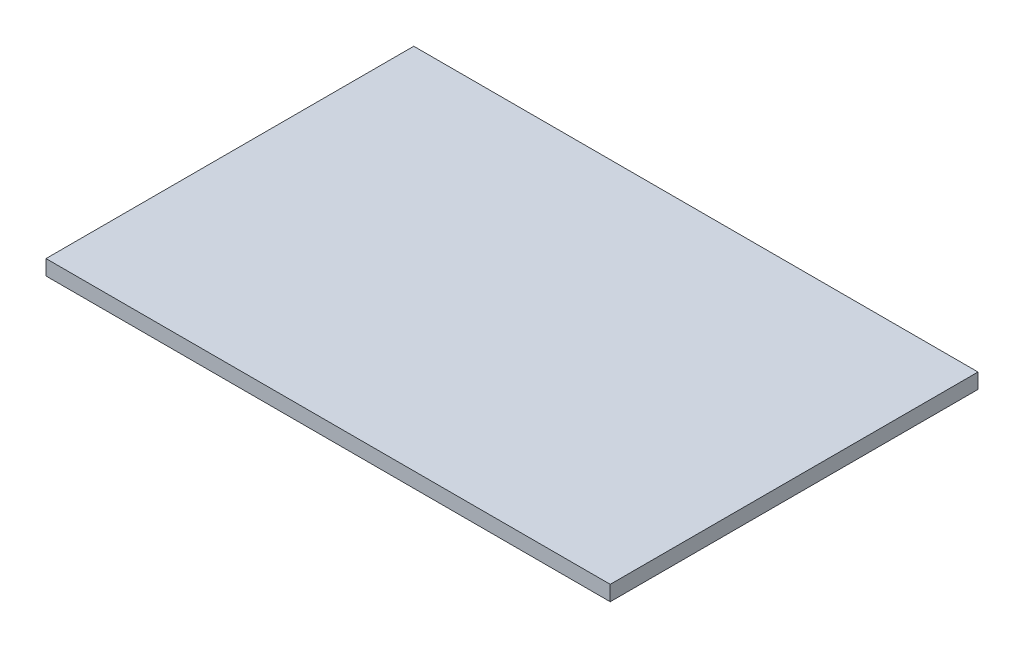
ISO-10303-21;
HEADER;
FILE_DESCRIPTION(('STEP AP214'),'2;1');
FILE_NAME('part.step','',(''),(''),'','','');
FILE_SCHEMA(('AUTOMOTIVE_DESIGN { 1 0 10303 214 1 1 1 1 }'));
ENDSEC;
DATA;
#1=APPLICATION_CONTEXT('core data for automotive mechanical design processes');
#2=APPLICATION_PROTOCOL_DEFINITION('international standard','automotive_design',2000,#1);
#3=PRODUCT_CONTEXT('',#1,'mechanical');
#4=PRODUCT('Part','Part','',(#3));
#5=PRODUCT_RELATED_PRODUCT_CATEGORY('part','',(#4));
#6=PRODUCT_DEFINITION_FORMATION('','',#4);
#7=PRODUCT_DEFINITION_CONTEXT('part definition',#1,'design');
#8=PRODUCT_DEFINITION('design','',#6,#7);
#9=PRODUCT_DEFINITION_SHAPE('','',#8);
#10=(LENGTH_UNIT() NAMED_UNIT(*) SI_UNIT(.MILLI.,.METRE.));
#11=(NAMED_UNIT(*) PLANE_ANGLE_UNIT() SI_UNIT($,.RADIAN.));
#12=(NAMED_UNIT(*) SI_UNIT($,.STERADIAN.) SOLID_ANGLE_UNIT());
#13=UNCERTAINTY_MEASURE_WITH_UNIT(LENGTH_MEASURE(1.E-05),#10,'distance_accuracy_value','');
#14=(GEOMETRIC_REPRESENTATION_CONTEXT(3) GLOBAL_UNCERTAINTY_ASSIGNED_CONTEXT((#13)) GLOBAL_UNIT_ASSIGNED_CONTEXT((#10,
#11,#12)) REPRESENTATION_CONTEXT('',''));
#15=CARTESIAN_POINT('',(0.,0.,0.));
#16=DIRECTION('',(0.,0.,1.));
#17=DIRECTION('',(1.,0.,0.));
#18=AXIS2_PLACEMENT_3D('',#15,#16,#17);
#19=CARTESIAN_POINT('',(56.,3.,-36.5));
#20=DIRECTION('',(-1.,0.,0.));
#21=DIRECTION('',(0.,0.,1.));
#22=AXIS2_PLACEMENT_3D('',#19,#20,#21);
#23=PLANE('',#22);
#24=DIRECTION('',(0.,0.,-1.));
#25=VECTOR('',#24,1.);
#26=CARTESIAN_POINT('',(56.,0.,-36.5));
#27=LINE('',#26,#25);
#28=CARTESIAN_POINT('',(56.,0.,36.5));
#29=VERTEX_POINT('',#28);
#30=CARTESIAN_POINT('',(56.,0.,-36.5));
#31=VERTEX_POINT('',#30);
#32=EDGE_CURVE('E107',#29,#31,#27,.T.);
#33=ORIENTED_EDGE('',*,*,#32,.T.);
#34=DIRECTION('',(0.,-1.,0.));
#35=VECTOR('',#34,1.);
#36=CARTESIAN_POINT('',(56.,3.,-36.5));
#37=LINE('',#36,#35);
#38=CARTESIAN_POINT('',(56.,3.,-36.5));
#39=VERTEX_POINT('',#38);
#40=EDGE_CURVE('E11',#39,#31,#37,.T.);
#41=ORIENTED_EDGE('',*,*,#40,.F.);
#42=DIRECTION('',(0.,0.,-1.));
#43=VECTOR('',#42,1.);
#44=CARTESIAN_POINT('',(56.,3.,-36.5));
#45=LINE('',#44,#43);
#46=CARTESIAN_POINT('',(56.,3.,36.5));
#47=VERTEX_POINT('',#46);
#48=EDGE_CURVE('E91',#47,#39,#45,.T.);
#49=ORIENTED_EDGE('',*,*,#48,.F.);
#50=DIRECTION('',(0.,-1.,0.));
#51=VECTOR('',#50,1.);
#52=CARTESIAN_POINT('',(56.,3.,36.5));
#53=LINE('',#52,#51);
#54=EDGE_CURVE('E103',#47,#29,#53,.T.);
#55=ORIENTED_EDGE('',*,*,#54,.T.);
#56=EDGE_LOOP('',(#33,#41,#49,#55));
#57=FACE_BOUND('',#56,.T.);
#58=ADVANCED_FACE('F39',(#57),#23,.F.);
#59=CARTESIAN_POINT('',(-56.,3.,-36.5));
#60=DIRECTION('',(0.,0.,1.));
#61=DIRECTION('',(1.,0.,0.));
#62=AXIS2_PLACEMENT_3D('',#59,#60,#61);
#63=PLANE('',#62);
#64=DIRECTION('',(-1.,0.,0.));
#65=VECTOR('',#64,1.);
#66=CARTESIAN_POINT('',(-56.,0.,-36.5));
#67=LINE('',#66,#65);
#68=CARTESIAN_POINT('',(-56.,0.,-36.5));
#69=VERTEX_POINT('',#68);
#70=EDGE_CURVE('E96',#31,#69,#67,.T.);
#71=ORIENTED_EDGE('',*,*,#70,.T.);
#72=DIRECTION('',(0.,-1.,0.));
#73=VECTOR('',#72,1.);
#74=CARTESIAN_POINT('',(-56.,3.,-36.5));
#75=LINE('',#74,#73);
#76=CARTESIAN_POINT('',(-56.,3.,-36.5));
#77=VERTEX_POINT('',#76);
#78=EDGE_CURVE('E48',#77,#69,#75,.T.);
#79=ORIENTED_EDGE('',*,*,#78,.F.);
#80=DIRECTION('',(-1.,0.,0.));
#81=VECTOR('',#80,1.);
#82=CARTESIAN_POINT('',(-56.,3.,-36.5));
#83=LINE('',#82,#81);
#84=EDGE_CURVE('E86',#39,#77,#83,.T.);
#85=ORIENTED_EDGE('',*,*,#84,.F.);
#86=ORIENTED_EDGE('',*,*,#40,.T.);
#87=EDGE_LOOP('',(#71,#79,#85,#86));
#88=FACE_BOUND('',#87,.T.);
#89=ADVANCED_FACE('F95',(#88),#63,.F.);
#90=CARTESIAN_POINT('',(-56.,3.,-36.5));
#91=DIRECTION('',(1.,0.,0.));
#92=DIRECTION('',(0.,0.,-1.));
#93=AXIS2_PLACEMENT_3D('',#90,#91,#92);
#94=PLANE('',#93);
#95=DIRECTION('',(0.,0.,1.));
#96=VECTOR('',#95,1.);
#97=CARTESIAN_POINT('',(-56.,0.,-36.5));
#98=LINE('',#97,#96);
#99=CARTESIAN_POINT('',(-56.,0.,36.5));
#100=VERTEX_POINT('',#99);
#101=EDGE_CURVE('E73',#69,#100,#98,.T.);
#102=ORIENTED_EDGE('',*,*,#101,.T.);
#103=DIRECTION('',(0.,-1.,0.));
#104=VECTOR('',#103,1.);
#105=CARTESIAN_POINT('',(-56.,3.,36.5));
#106=LINE('',#105,#104);
#107=CARTESIAN_POINT('',(-56.,3.,36.5));
#108=VERTEX_POINT('',#107);
#109=EDGE_CURVE('E98',#108,#100,#106,.T.);
#110=ORIENTED_EDGE('',*,*,#109,.F.);
#111=DIRECTION('',(0.,0.,1.));
#112=VECTOR('',#111,1.);
#113=CARTESIAN_POINT('',(-56.,3.,-36.5));
#114=LINE('',#113,#112);
#115=EDGE_CURVE('E89',#77,#108,#114,.T.);
#116=ORIENTED_EDGE('',*,*,#115,.F.);
#117=ORIENTED_EDGE('',*,*,#78,.T.);
#118=EDGE_LOOP('',(#102,#110,#116,#117));
#119=FACE_BOUND('',#118,.T.);
#120=ADVANCED_FACE('F99',(#119),#94,.F.);
#121=CARTESIAN_POINT('',(-56.,3.,36.5));
#122=DIRECTION('',(0.,0.,-1.));
#123=DIRECTION('',(-1.,0.,0.));
#124=AXIS2_PLACEMENT_3D('',#121,#122,#123);
#125=PLANE('',#124);
#126=DIRECTION('',(1.,0.,0.));
#127=VECTOR('',#126,1.);
#128=CARTESIAN_POINT('',(-56.,0.,36.5));
#129=LINE('',#128,#127);
#130=EDGE_CURVE('E79',#100,#29,#129,.T.);
#131=ORIENTED_EDGE('',*,*,#130,.T.);
#132=ORIENTED_EDGE('',*,*,#54,.F.);
#133=DIRECTION('',(1.,0.,0.));
#134=VECTOR('',#133,1.);
#135=CARTESIAN_POINT('',(-56.,3.,36.5));
#136=LINE('',#135,#134);
#137=EDGE_CURVE('E56',#108,#47,#136,.T.);
#138=ORIENTED_EDGE('',*,*,#137,.F.);
#139=ORIENTED_EDGE('',*,*,#109,.T.);
#140=EDGE_LOOP('',(#131,#132,#138,#139));
#141=FACE_BOUND('',#140,.T.);
#142=ADVANCED_FACE('F120',(#141),#125,.F.);
#143=CARTESIAN_POINT('',(0.,3.,0.));
#144=DIRECTION('',(0.,1.,0.));
#145=DIRECTION('',(0.,0.,1.));
#146=AXIS2_PLACEMENT_3D('',#143,#144,#145);
#147=PLANE('',#146);
#148=ORIENTED_EDGE('',*,*,#48,.T.);
#149=ORIENTED_EDGE('',*,*,#84,.T.);
#150=ORIENTED_EDGE('',*,*,#115,.T.);
#151=ORIENTED_EDGE('',*,*,#137,.T.);
#152=EDGE_LOOP('',(#148,#149,#150,#151));
#153=FACE_BOUND('',#152,.T.);
#154=ADVANCED_FACE('F87',(#153),#147,.T.);
#155=CARTESIAN_POINT('',(0.,0.,0.));
#156=DIRECTION('',(0.,1.,0.));
#157=DIRECTION('',(0.,0.,1.));
#158=AXIS2_PLACEMENT_3D('',#155,#156,#157);
#159=PLANE('',#158);
#160=ORIENTED_EDGE('',*,*,#32,.F.);
#161=ORIENTED_EDGE('',*,*,#130,.F.);
#162=ORIENTED_EDGE('',*,*,#101,.F.);
#163=ORIENTED_EDGE('',*,*,#70,.F.);
#164=EDGE_LOOP('',(#160,#161,#162,#163));
#165=FACE_BOUND('',#164,.T.);
#166=ADVANCED_FACE('F123',(#165),#159,.F.);
#167=CLOSED_SHELL('',(#58,#89,#120,#142,#154,#166));
#168=MANIFOLD_SOLID_BREP('B2',#167);
#169=ADVANCED_BREP_SHAPE_REPRESENTATION('',(#18,#168),#14);
#170=SHAPE_DEFINITION_REPRESENTATION(#9,#169);
ENDSEC;
END-ISO-10303-21;
